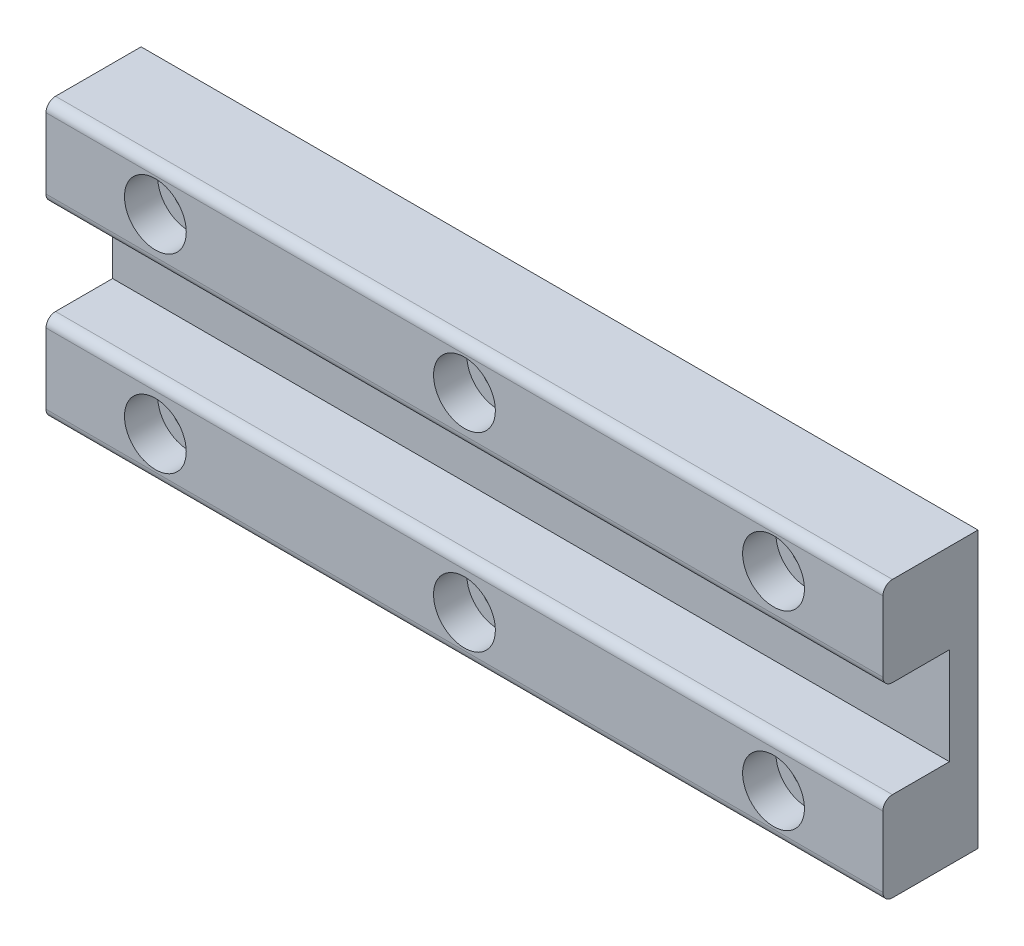
ISO-10303-21;
HEADER;
FILE_DESCRIPTION(('STEP AP214'),'2;1');
FILE_NAME('part.step','',(''),(''),'','','');
FILE_SCHEMA(('AUTOMOTIVE_DESIGN { 1 0 10303 214 1 1 1 1 }'));
ENDSEC;
DATA;
#1=APPLICATION_CONTEXT('core data for automotive mechanical design processes');
#2=APPLICATION_PROTOCOL_DEFINITION('international standard','automotive_design',2000,#1);
#3=PRODUCT_CONTEXT('',#1,'mechanical');
#4=PRODUCT('Part','Part','',(#3));
#5=PRODUCT_RELATED_PRODUCT_CATEGORY('part','',(#4));
#6=PRODUCT_DEFINITION_FORMATION('','',#4);
#7=PRODUCT_DEFINITION_CONTEXT('part definition',#1,'design');
#8=PRODUCT_DEFINITION('design','',#6,#7);
#9=PRODUCT_DEFINITION_SHAPE('','',#8);
#10=(LENGTH_UNIT() NAMED_UNIT(*) SI_UNIT(.MILLI.,.METRE.));
#11=(NAMED_UNIT(*) PLANE_ANGLE_UNIT() SI_UNIT($,.RADIAN.));
#12=(NAMED_UNIT(*) SI_UNIT($,.STERADIAN.) SOLID_ANGLE_UNIT());
#13=UNCERTAINTY_MEASURE_WITH_UNIT(LENGTH_MEASURE(1.E-05),#10,'distance_accuracy_value','');
#14=(GEOMETRIC_REPRESENTATION_CONTEXT(3) GLOBAL_UNCERTAINTY_ASSIGNED_CONTEXT((#13)) GLOBAL_UNIT_ASSIGNED_CONTEXT((#10,
#11,#12)) REPRESENTATION_CONTEXT('',''));
#15=CARTESIAN_POINT('',(0.,0.,0.));
#16=DIRECTION('',(0.,0.,1.));
#17=DIRECTION('',(1.,0.,0.));
#18=AXIS2_PLACEMENT_3D('',#15,#16,#17);
#19=CARTESIAN_POINT('',(-42.,10.,5.));
#20=DIRECTION('',(0.,0.,1.));
#21=DIRECTION('',(1.,0.,0.));
#22=AXIS2_PLACEMENT_3D('',#19,#20,#21);
#23=CYLINDRICAL_SURFACE('',#22,1.75);
#24=CARTESIAN_POINT('',(-42.,10.,5.));
#25=DIRECTION('',(0.,0.,1.));
#26=DIRECTION('',(1.,0.,0.));
#27=AXIS2_PLACEMENT_3D('',#24,#25,#26);
#28=CIRCLE('',#27,1.75);
#29=CARTESIAN_POINT('',(-40.25,10.,5.));
#30=VERTEX_POINT('',#29);
#31=EDGE_CURVE('E157',#30,#30,#28,.T.);
#32=ORIENTED_EDGE('',*,*,#31,.F.);
#33=EDGE_LOOP('',(#32));
#34=FACE_BOUND('',#33,.T.);
#35=CARTESIAN_POINT('',(-42.,10.,11.5));
#36=DIRECTION('',(0.,0.,1.));
#37=DIRECTION('',(1.,0.,0.));
#38=AXIS2_PLACEMENT_3D('',#35,#36,#37);
#39=CIRCLE('',#38,1.75);
#40=CARTESIAN_POINT('',(-40.25,10.,11.5));
#41=VERTEX_POINT('',#40);
#42=EDGE_CURVE('E216',#41,#41,#39,.F.);
#43=ORIENTED_EDGE('',*,*,#42,.F.);
#44=EDGE_LOOP('',(#43));
#45=FACE_BOUND('',#44,.T.);
#46=ADVANCED_FACE('F40',(#34,#45),#23,.F.);
#47=CARTESIAN_POINT('',(-9.49999999999997,10.,5.));
#48=DIRECTION('',(0.,0.,1.));
#49=DIRECTION('',(1.,0.,0.));
#50=AXIS2_PLACEMENT_3D('',#47,#48,#49);
#51=CYLINDRICAL_SURFACE('',#50,1.75);
#52=CARTESIAN_POINT('',(-9.49999999999997,10.,5.));
#53=DIRECTION('',(0.,0.,1.));
#54=DIRECTION('',(1.,0.,0.));
#55=AXIS2_PLACEMENT_3D('',#52,#53,#54);
#56=CIRCLE('',#55,1.75);
#57=CARTESIAN_POINT('',(-7.74999999999997,10.,5.));
#58=VERTEX_POINT('',#57);
#59=EDGE_CURVE('E160',#58,#58,#56,.T.);
#60=ORIENTED_EDGE('',*,*,#59,.F.);
#61=EDGE_LOOP('',(#60));
#62=FACE_BOUND('',#61,.T.);
#63=CARTESIAN_POINT('',(-9.49999999999997,10.,11.5));
#64=DIRECTION('',(0.,0.,1.));
#65=DIRECTION('',(1.,0.,0.));
#66=AXIS2_PLACEMENT_3D('',#63,#64,#65);
#67=CIRCLE('',#66,1.75);
#68=CARTESIAN_POINT('',(-7.74999999999997,10.,11.5));
#69=VERTEX_POINT('',#68);
#70=EDGE_CURVE('E213',#69,#69,#67,.F.);
#71=ORIENTED_EDGE('',*,*,#70,.F.);
#72=EDGE_LOOP('',(#71));
#73=FACE_BOUND('',#72,.T.);
#74=ADVANCED_FACE('F287',(#62,#73),#51,.F.);
#75=CARTESIAN_POINT('',(23.,10.,5.));
#76=DIRECTION('',(0.,0.,1.));
#77=DIRECTION('',(1.,0.,0.));
#78=AXIS2_PLACEMENT_3D('',#75,#76,#77);
#79=CYLINDRICAL_SURFACE('',#78,1.75);
#80=CARTESIAN_POINT('',(23.,10.,5.));
#81=DIRECTION('',(0.,0.,1.));
#82=DIRECTION('',(1.,0.,0.));
#83=AXIS2_PLACEMENT_3D('',#80,#81,#82);
#84=CIRCLE('',#83,1.75);
#85=CARTESIAN_POINT('',(24.75,10.,5.));
#86=VERTEX_POINT('',#85);
#87=EDGE_CURVE('E340',#86,#86,#84,.T.);
#88=ORIENTED_EDGE('',*,*,#87,.F.);
#89=EDGE_LOOP('',(#88));
#90=FACE_BOUND('',#89,.T.);
#91=CARTESIAN_POINT('',(23.,10.,11.5));
#92=DIRECTION('',(0.,0.,1.));
#93=DIRECTION('',(1.,0.,0.));
#94=AXIS2_PLACEMENT_3D('',#91,#92,#93);
#95=CIRCLE('',#94,1.75);
#96=CARTESIAN_POINT('',(24.75,10.,11.5));
#97=VERTEX_POINT('',#96);
#98=EDGE_CURVE('E210',#97,#97,#95,.F.);
#99=ORIENTED_EDGE('',*,*,#98,.F.);
#100=EDGE_LOOP('',(#99));
#101=FACE_BOUND('',#100,.T.);
#102=ADVANCED_FACE('F293',(#90,#101),#79,.F.);
#103=CARTESIAN_POINT('',(23.,-9.99999999999998,5.));
#104=DIRECTION('',(0.,0.,1.));
#105=DIRECTION('',(1.,0.,0.));
#106=AXIS2_PLACEMENT_3D('',#103,#104,#105);
#107=CYLINDRICAL_SURFACE('',#106,1.75);
#108=CARTESIAN_POINT('',(23.,-9.99999999999998,5.));
#109=DIRECTION('',(0.,0.,1.));
#110=DIRECTION('',(1.,0.,0.));
#111=AXIS2_PLACEMENT_3D('',#108,#109,#110);
#112=CIRCLE('',#111,1.75);
#113=CARTESIAN_POINT('',(24.75,-9.99999999999998,5.));
#114=VERTEX_POINT('',#113);
#115=EDGE_CURVE('E336',#114,#114,#112,.T.);
#116=ORIENTED_EDGE('',*,*,#115,.F.);
#117=EDGE_LOOP('',(#116));
#118=FACE_BOUND('',#117,.T.);
#119=CARTESIAN_POINT('',(23.,-9.99999999999998,11.5));
#120=DIRECTION('',(0.,0.,1.));
#121=DIRECTION('',(1.,0.,0.));
#122=AXIS2_PLACEMENT_3D('',#119,#120,#121);
#123=CIRCLE('',#122,1.75);
#124=CARTESIAN_POINT('',(24.75,-9.99999999999998,11.5));
#125=VERTEX_POINT('',#124);
#126=EDGE_CURVE('E207',#125,#125,#123,.F.);
#127=ORIENTED_EDGE('',*,*,#126,.F.);
#128=EDGE_LOOP('',(#127));
#129=FACE_BOUND('',#128,.T.);
#130=ADVANCED_FACE('F413',(#118,#129),#107,.F.);
#131=CARTESIAN_POINT('',(-9.49999999999997,-9.99999999999999,5.));
#132=DIRECTION('',(0.,0.,1.));
#133=DIRECTION('',(1.,0.,0.));
#134=AXIS2_PLACEMENT_3D('',#131,#132,#133);
#135=CYLINDRICAL_SURFACE('',#134,1.75);
#136=CARTESIAN_POINT('',(-9.49999999999997,-9.99999999999999,5.));
#137=DIRECTION('',(0.,0.,1.));
#138=DIRECTION('',(1.,0.,0.));
#139=AXIS2_PLACEMENT_3D('',#136,#137,#138);
#140=CIRCLE('',#139,1.75);
#141=CARTESIAN_POINT('',(-7.74999999999997,-9.99999999999999,5.));
#142=VERTEX_POINT('',#141);
#143=EDGE_CURVE('E332',#142,#142,#140,.T.);
#144=ORIENTED_EDGE('',*,*,#143,.F.);
#145=EDGE_LOOP('',(#144));
#146=FACE_BOUND('',#145,.T.);
#147=CARTESIAN_POINT('',(-9.49999999999997,-9.99999999999999,11.5));
#148=DIRECTION('',(0.,0.,1.));
#149=DIRECTION('',(1.,0.,0.));
#150=AXIS2_PLACEMENT_3D('',#147,#148,#149);
#151=CIRCLE('',#150,1.75);
#152=CARTESIAN_POINT('',(-7.74999999999997,-9.99999999999999,11.5));
#153=VERTEX_POINT('',#152);
#154=EDGE_CURVE('E203',#153,#153,#151,.F.);
#155=ORIENTED_EDGE('',*,*,#154,.F.);
#156=EDGE_LOOP('',(#155));
#157=FACE_BOUND('',#156,.T.);
#158=ADVANCED_FACE('F416',(#146,#157),#135,.F.);
#159=CARTESIAN_POINT('',(-42.,-9.99999999999999,5.));
#160=DIRECTION('',(0.,0.,1.));
#161=DIRECTION('',(1.,0.,0.));
#162=AXIS2_PLACEMENT_3D('',#159,#160,#161);
#163=CYLINDRICAL_SURFACE('',#162,1.75);
#164=CARTESIAN_POINT('',(-42.,-9.99999999999999,5.));
#165=DIRECTION('',(0.,0.,1.));
#166=DIRECTION('',(1.,0.,0.));
#167=AXIS2_PLACEMENT_3D('',#164,#165,#166);
#168=CIRCLE('',#167,1.75);
#169=CARTESIAN_POINT('',(-40.25,-9.99999999999999,5.));
#170=VERTEX_POINT('',#169);
#171=EDGE_CURVE('E219',#170,#170,#168,.T.);
#172=ORIENTED_EDGE('',*,*,#171,.F.);
#173=EDGE_LOOP('',(#172));
#174=FACE_BOUND('',#173,.T.);
#175=CARTESIAN_POINT('',(-42.,-9.99999999999999,11.5));
#176=DIRECTION('',(0.,0.,1.));
#177=DIRECTION('',(1.,0.,0.));
#178=AXIS2_PLACEMENT_3D('',#175,#176,#177);
#179=CIRCLE('',#178,1.75);
#180=CARTESIAN_POINT('',(-40.25,-9.99999999999999,11.5));
#181=VERTEX_POINT('',#180);
#182=EDGE_CURVE('E200',#181,#181,#179,.F.);
#183=ORIENTED_EDGE('',*,*,#182,.F.);
#184=EDGE_LOOP('',(#183));
#185=FACE_BOUND('',#184,.T.);
#186=ADVANCED_FACE('F300',(#174,#185),#163,.F.);
#187=CARTESIAN_POINT('',(0.,0.,15.));
#188=DIRECTION('',(0.,0.,1.));
#189=DIRECTION('',(1.,0.,0.));
#190=AXIS2_PLACEMENT_3D('',#187,#188,#189);
#191=PLANE('',#190);
#192=CARTESIAN_POINT('',(23.,10.,15.));
#193=DIRECTION('',(0.,0.,1.));
#194=DIRECTION('',(1.,0.,0.));
#195=AXIS2_PLACEMENT_3D('',#192,#193,#194);
#196=CIRCLE('',#195,3.25);
#197=CARTESIAN_POINT('',(26.25,10.,15.));
#198=VERTEX_POINT('',#197);
#199=EDGE_CURVE('E373',#198,#198,#196,.T.);
#200=ORIENTED_EDGE('',*,*,#199,.F.);
#201=EDGE_LOOP('',(#200));
#202=FACE_BOUND('',#201,.T.);
#203=CARTESIAN_POINT('',(-9.49999999999997,10.,15.));
#204=DIRECTION('',(0.,0.,1.));
#205=DIRECTION('',(1.,0.,0.));
#206=AXIS2_PLACEMENT_3D('',#203,#204,#205);
#207=CIRCLE('',#206,3.25);
#208=CARTESIAN_POINT('',(-6.24999999999997,10.,15.));
#209=VERTEX_POINT('',#208);
#210=EDGE_CURVE('E379',#209,#209,#207,.T.);
#211=ORIENTED_EDGE('',*,*,#210,.F.);
#212=EDGE_LOOP('',(#211));
#213=FACE_BOUND('',#212,.T.);
#214=CARTESIAN_POINT('',(-42.,10.,15.));
#215=DIRECTION('',(0.,0.,1.));
#216=DIRECTION('',(1.,0.,0.));
#217=AXIS2_PLACEMENT_3D('',#214,#215,#216);
#218=CIRCLE('',#217,3.25);
#219=CARTESIAN_POINT('',(-38.75,10.,15.));
#220=VERTEX_POINT('',#219);
#221=EDGE_CURVE('E347',#220,#220,#218,.T.);
#222=ORIENTED_EDGE('',*,*,#221,.F.);
#223=EDGE_LOOP('',(#222));
#224=FACE_BOUND('',#223,.T.);
#225=DIRECTION('',(0.,-1.,0.));
#226=VECTOR('',#225,1.);
#227=CARTESIAN_POINT('',(-53.5,-10.,15.));
#228=LINE('',#227,#226);
#229=CARTESIAN_POINT('',(-53.5,13.5,15.));
#230=VERTEX_POINT('',#229);
#231=CARTESIAN_POINT('',(-53.5,6.1,15.));
#232=VERTEX_POINT('',#231);
#233=EDGE_CURVE('E180',#230,#232,#228,.T.);
#234=ORIENTED_EDGE('',*,*,#233,.T.);
#235=DIRECTION('',(-1.,0.,0.));
#236=VECTOR('',#235,1.);
#237=CARTESIAN_POINT('',(34.5,6.1,15.));
#238=LINE('',#237,#236);
#239=CARTESIAN_POINT('',(34.5,6.1,15.));
#240=VERTEX_POINT('',#239);
#241=EDGE_CURVE('E48',#232,#240,#238,.F.);
#242=ORIENTED_EDGE('',*,*,#241,.T.);
#243=DIRECTION('',(0.,1.,0.));
#244=VECTOR('',#243,1.);
#245=CARTESIAN_POINT('',(34.5,-9.99999999999999,15.));
#246=LINE('',#245,#244);
#247=CARTESIAN_POINT('',(34.5,13.5,15.));
#248=VERTEX_POINT('',#247);
#249=EDGE_CURVE('E168',#240,#248,#246,.T.);
#250=ORIENTED_EDGE('',*,*,#249,.T.);
#251=DIRECTION('',(1.,0.,0.));
#252=VECTOR('',#251,1.);
#253=CARTESIAN_POINT('',(0.,13.5,15.));
#254=LINE('',#253,#252);
#255=EDGE_CURVE('E245',#248,#230,#254,.F.);
#256=ORIENTED_EDGE('',*,*,#255,.T.);
#257=EDGE_LOOP('',(#234,#242,#250,#256));
#258=FACE_BOUND('',#257,.T.);
#259=ADVANCED_FACE('F249',(#202,#213,#224,#258),#191,.T.);
#260=CARTESIAN_POINT('',(-53.5,-10.,15.));
#261=DIRECTION('',(1.,0.,0.));
#262=DIRECTION('',(0.,0.,-1.));
#263=AXIS2_PLACEMENT_3D('',#260,#261,#262);
#264=PLANE('',#263);
#265=DIRECTION('',(0.,0.,-1.));
#266=VECTOR('',#265,1.);
#267=CARTESIAN_POINT('',(-53.5,-14.5,15.));
#268=LINE('',#267,#266);
#269=CARTESIAN_POINT('',(-53.5,-14.5,14.));
#270=VERTEX_POINT('',#269);
#271=CARTESIAN_POINT('',(-53.5,-14.5,5.));
#272=VERTEX_POINT('',#271);
#273=EDGE_CURVE('E151',#270,#272,#268,.T.);
#274=ORIENTED_EDGE('',*,*,#273,.F.);
#275=CARTESIAN_POINT('',(-53.5,-13.5,14.));
#276=DIRECTION('',(1.,0.,0.));
#277=DIRECTION('',(0.,0.,-1.));
#278=AXIS2_PLACEMENT_3D('',#275,#276,#277);
#279=CIRCLE('',#278,1.);
#280=CARTESIAN_POINT('',(-53.5,-13.5,15.));
#281=VERTEX_POINT('',#280);
#282=EDGE_CURVE('E237',#270,#281,#279,.F.);
#283=ORIENTED_EDGE('',*,*,#282,.T.);
#284=CARTESIAN_POINT('',(-53.5,-6.1,15.));
#285=VERTEX_POINT('',#284);
#286=EDGE_CURVE('E142',#285,#281,#228,.T.);
#287=ORIENTED_EDGE('',*,*,#286,.F.);
#288=CARTESIAN_POINT('',(-53.5,-6.1,14.));
#289=DIRECTION('',(1.,0.,0.));
#290=DIRECTION('',(0.,0.,-1.));
#291=AXIS2_PLACEMENT_3D('',#288,#289,#290);
#292=CIRCLE('',#291,1.);
#293=CARTESIAN_POINT('',(-53.5,-5.1,14.));
#294=VERTEX_POINT('',#293);
#295=EDGE_CURVE('E55',#285,#294,#292,.F.);
#296=ORIENTED_EDGE('',*,*,#295,.T.);
#297=DIRECTION('',(0.,0.,1.));
#298=VECTOR('',#297,1.);
#299=CARTESIAN_POINT('',(-53.5,-5.1,8.));
#300=LINE('',#299,#298);
#301=CARTESIAN_POINT('',(-53.5,-5.1,8.));
#302=VERTEX_POINT('',#301);
#303=EDGE_CURVE('E186',#302,#294,#300,.T.);
#304=ORIENTED_EDGE('',*,*,#303,.F.);
#305=DIRECTION('',(0.,-1.,0.));
#306=VECTOR('',#305,1.);
#307=CARTESIAN_POINT('',(-53.5,-10.,8.));
#308=LINE('',#307,#306);
#309=CARTESIAN_POINT('',(-53.5,5.1,8.));
#310=VERTEX_POINT('',#309);
#311=EDGE_CURVE('E184',#310,#302,#308,.T.);
#312=ORIENTED_EDGE('',*,*,#311,.F.);
#313=DIRECTION('',(0.,0.,1.));
#314=VECTOR('',#313,1.);
#315=CARTESIAN_POINT('',(-53.5,5.1,8.));
#316=LINE('',#315,#314);
#317=CARTESIAN_POINT('',(-53.5,5.1,14.));
#318=VERTEX_POINT('',#317);
#319=EDGE_CURVE('E177',#310,#318,#316,.T.);
#320=ORIENTED_EDGE('',*,*,#319,.T.);
#321=CARTESIAN_POINT('',(-53.5,6.1,14.));
#322=DIRECTION('',(1.,0.,0.));
#323=DIRECTION('',(0.,0.,-1.));
#324=AXIS2_PLACEMENT_3D('',#321,#322,#323);
#325=CIRCLE('',#324,1.);
#326=EDGE_CURVE('E234',#318,#232,#325,.F.);
#327=ORIENTED_EDGE('',*,*,#326,.T.);
#328=ORIENTED_EDGE('',*,*,#233,.F.);
#329=CARTESIAN_POINT('',(-53.5,13.5,14.));
#330=DIRECTION('',(1.,0.,0.));
#331=DIRECTION('',(0.,0.,-1.));
#332=AXIS2_PLACEMENT_3D('',#329,#330,#331);
#333=CIRCLE('',#332,1.);
#334=CARTESIAN_POINT('',(-53.5,14.5,14.));
#335=VERTEX_POINT('',#334);
#336=EDGE_CURVE('E62',#230,#335,#333,.F.);
#337=ORIENTED_EDGE('',*,*,#336,.T.);
#338=DIRECTION('',(0.,0.,-1.));
#339=VECTOR('',#338,1.);
#340=CARTESIAN_POINT('',(-53.5,14.5,15.));
#341=LINE('',#340,#339);
#342=CARTESIAN_POINT('',(-53.5,14.5,5.));
#343=VERTEX_POINT('',#342);
#344=EDGE_CURVE('E166',#335,#343,#341,.T.);
#345=ORIENTED_EDGE('',*,*,#344,.T.);
#346=DIRECTION('',(0.,-1.,0.));
#347=VECTOR('',#346,1.);
#348=CARTESIAN_POINT('',(-53.5,-10.,5.));
#349=LINE('',#348,#347);
#350=EDGE_CURVE('E175',#343,#272,#349,.T.);
#351=ORIENTED_EDGE('',*,*,#350,.T.);
#352=EDGE_LOOP('',(#274,#283,#287,#296,#304,#312,#320,#327,#328,#337,#345,#351));
#353=FACE_BOUND('',#352,.T.);
#354=ADVANCED_FACE('F260',(#353),#264,.F.);
#355=CARTESIAN_POINT('',(34.5,-9.99999999999999,15.));
#356=DIRECTION('',(-1.,0.,0.));
#357=DIRECTION('',(0.,0.,1.));
#358=AXIS2_PLACEMENT_3D('',#355,#356,#357);
#359=PLANE('',#358);
#360=CARTESIAN_POINT('',(34.5,-13.5,15.));
#361=VERTEX_POINT('',#360);
#362=CARTESIAN_POINT('',(34.5,-6.1,15.));
#363=VERTEX_POINT('',#362);
#364=EDGE_CURVE('E181',#361,#363,#246,.T.);
#365=ORIENTED_EDGE('',*,*,#364,.F.);
#366=CARTESIAN_POINT('',(34.5,-13.5,14.));
#367=DIRECTION('',(-1.,0.,0.));
#368=DIRECTION('',(0.,0.,1.));
#369=AXIS2_PLACEMENT_3D('',#366,#367,#368);
#370=CIRCLE('',#369,1.);
#371=CARTESIAN_POINT('',(34.5,-14.5,14.));
#372=VERTEX_POINT('',#371);
#373=EDGE_CURVE('E156',#361,#372,#370,.F.);
#374=ORIENTED_EDGE('',*,*,#373,.T.);
#375=DIRECTION('',(0.,0.,1.));
#376=VECTOR('',#375,1.);
#377=CARTESIAN_POINT('',(34.5,-14.5,15.));
#378=LINE('',#377,#376);
#379=CARTESIAN_POINT('',(34.5,-14.5,5.));
#380=VERTEX_POINT('',#379);
#381=EDGE_CURVE('E148',#380,#372,#378,.T.);
#382=ORIENTED_EDGE('',*,*,#381,.F.);
#383=DIRECTION('',(0.,1.,0.));
#384=VECTOR('',#383,1.);
#385=CARTESIAN_POINT('',(34.5,-9.99999999999999,5.));
#386=LINE('',#385,#384);
#387=CARTESIAN_POINT('',(34.5,14.5,5.));
#388=VERTEX_POINT('',#387);
#389=EDGE_CURVE('E131',#380,#388,#386,.T.);
#390=ORIENTED_EDGE('',*,*,#389,.T.);
#391=DIRECTION('',(0.,0.,1.));
#392=VECTOR('',#391,1.);
#393=CARTESIAN_POINT('',(34.5,14.5,15.));
#394=LINE('',#393,#392);
#395=CARTESIAN_POINT('',(34.5,14.5,14.));
#396=VERTEX_POINT('',#395);
#397=EDGE_CURVE('E165',#388,#396,#394,.T.);
#398=ORIENTED_EDGE('',*,*,#397,.T.);
#399=CARTESIAN_POINT('',(34.5,13.5,14.));
#400=DIRECTION('',(-1.,0.,0.));
#401=DIRECTION('',(0.,0.,1.));
#402=AXIS2_PLACEMENT_3D('',#399,#400,#401);
#403=CIRCLE('',#402,1.);
#404=EDGE_CURVE('E224',#396,#248,#403,.F.);
#405=ORIENTED_EDGE('',*,*,#404,.T.);
#406=ORIENTED_EDGE('',*,*,#249,.F.);
#407=CARTESIAN_POINT('',(34.5,6.1,14.));
#408=DIRECTION('',(-1.,0.,0.));
#409=DIRECTION('',(0.,0.,1.));
#410=AXIS2_PLACEMENT_3D('',#407,#408,#409);
#411=CIRCLE('',#410,1.);
#412=CARTESIAN_POINT('',(34.5,5.1,14.));
#413=VERTEX_POINT('',#412);
#414=EDGE_CURVE('E226',#240,#413,#411,.F.);
#415=ORIENTED_EDGE('',*,*,#414,.T.);
#416=DIRECTION('',(0.,0.,1.));
#417=VECTOR('',#416,1.);
#418=CARTESIAN_POINT('',(34.5,5.1,8.));
#419=LINE('',#418,#417);
#420=CARTESIAN_POINT('',(34.5,5.1,8.));
#421=VERTEX_POINT('',#420);
#422=EDGE_CURVE('E189',#421,#413,#419,.T.);
#423=ORIENTED_EDGE('',*,*,#422,.F.);
#424=DIRECTION('',(0.,1.,0.));
#425=VECTOR('',#424,1.);
#426=CARTESIAN_POINT('',(34.5,-9.99999999999999,8.));
#427=LINE('',#426,#425);
#428=CARTESIAN_POINT('',(34.5,-5.1,8.));
#429=VERTEX_POINT('',#428);
#430=EDGE_CURVE('E171',#429,#421,#427,.T.);
#431=ORIENTED_EDGE('',*,*,#430,.F.);
#432=DIRECTION('',(0.,0.,1.));
#433=VECTOR('',#432,1.);
#434=CARTESIAN_POINT('',(34.5,-5.1,8.));
#435=LINE('',#434,#433);
#436=CARTESIAN_POINT('',(34.5,-5.1,14.));
#437=VERTEX_POINT('',#436);
#438=EDGE_CURVE('E143',#429,#437,#435,.T.);
#439=ORIENTED_EDGE('',*,*,#438,.T.);
#440=CARTESIAN_POINT('',(34.5,-6.1,14.));
#441=DIRECTION('',(-1.,0.,0.));
#442=DIRECTION('',(0.,0.,1.));
#443=AXIS2_PLACEMENT_3D('',#440,#441,#442);
#444=CIRCLE('',#443,1.);
#445=EDGE_CURVE('E228',#437,#363,#444,.F.);
#446=ORIENTED_EDGE('',*,*,#445,.T.);
#447=EDGE_LOOP('',(#365,#374,#382,#390,#398,#405,#406,#415,#423,#431,#439,#446));
#448=FACE_BOUND('',#447,.T.);
#449=ADVANCED_FACE('F155',(#448),#359,.F.);
#450=CARTESIAN_POINT('',(-42.,-9.99999999999999,15.));
#451=DIRECTION('',(0.,0.,1.));
#452=DIRECTION('',(1.,0.,0.));
#453=AXIS2_PLACEMENT_3D('',#450,#451,#452);
#454=CIRCLE('',#453,3.25);
#455=CARTESIAN_POINT('',(-38.75,-9.99999999999999,15.));
#456=VERTEX_POINT('',#455);
#457=EDGE_CURVE('E355',#456,#456,#454,.T.);
#458=ORIENTED_EDGE('',*,*,#457,.F.);
#459=EDGE_LOOP('',(#458));
#460=FACE_BOUND('',#459,.T.);
#461=CARTESIAN_POINT('',(-9.49999999999997,-9.99999999999999,15.));
#462=DIRECTION('',(0.,0.,1.));
#463=DIRECTION('',(1.,0.,0.));
#464=AXIS2_PLACEMENT_3D('',#461,#462,#463);
#465=CIRCLE('',#464,3.25);
#466=CARTESIAN_POINT('',(-6.24999999999997,-9.99999999999999,15.));
#467=VERTEX_POINT('',#466);
#468=EDGE_CURVE('E361',#467,#467,#465,.T.);
#469=ORIENTED_EDGE('',*,*,#468,.F.);
#470=EDGE_LOOP('',(#469));
#471=FACE_BOUND('',#470,.T.);
#472=CARTESIAN_POINT('',(23.,-9.99999999999998,15.));
#473=DIRECTION('',(0.,0.,1.));
#474=DIRECTION('',(1.,0.,0.));
#475=AXIS2_PLACEMENT_3D('',#472,#473,#474);
#476=CIRCLE('',#475,3.25);
#477=CARTESIAN_POINT('',(26.25,-9.99999999999998,15.));
#478=VERTEX_POINT('',#477);
#479=EDGE_CURVE('E367',#478,#478,#476,.T.);
#480=ORIENTED_EDGE('',*,*,#479,.F.);
#481=EDGE_LOOP('',(#480));
#482=FACE_BOUND('',#481,.T.);
#483=ORIENTED_EDGE('',*,*,#286,.T.);
#484=DIRECTION('',(1.,0.,0.));
#485=VECTOR('',#484,1.);
#486=CARTESIAN_POINT('',(34.5,-13.5,15.));
#487=LINE('',#486,#485);
#488=EDGE_CURVE('E221',#281,#361,#487,.T.);
#489=ORIENTED_EDGE('',*,*,#488,.T.);
#490=ORIENTED_EDGE('',*,*,#364,.T.);
#491=DIRECTION('',(1.,0.,0.));
#492=VECTOR('',#491,1.);
#493=CARTESIAN_POINT('',(-53.5,-6.1,15.));
#494=LINE('',#493,#492);
#495=EDGE_CURVE('E188',#363,#285,#494,.F.);
#496=ORIENTED_EDGE('',*,*,#495,.T.);
#497=EDGE_LOOP('',(#483,#489,#490,#496));
#498=FACE_BOUND('',#497,.T.);
#499=ADVANCED_FACE('F273',(#460,#471,#482,#498),#191,.T.);
#500=CARTESIAN_POINT('',(-53.5,0.,8.));
#501=DIRECTION('',(0.,0.,1.));
#502=DIRECTION('',(1.,0.,0.));
#503=AXIS2_PLACEMENT_3D('',#500,#501,#502);
#504=PLANE('',#503);
#505=ORIENTED_EDGE('',*,*,#311,.T.);
#506=DIRECTION('',(1.,0.,0.));
#507=VECTOR('',#506,1.);
#508=CARTESIAN_POINT('',(-53.5,-5.1,8.));
#509=LINE('',#508,#507);
#510=EDGE_CURVE('E173',#302,#429,#509,.T.);
#511=ORIENTED_EDGE('',*,*,#510,.T.);
#512=ORIENTED_EDGE('',*,*,#430,.T.);
#513=DIRECTION('',(-1.,0.,0.));
#514=VECTOR('',#513,1.);
#515=CARTESIAN_POINT('',(-53.5,5.1,8.));
#516=LINE('',#515,#514);
#517=EDGE_CURVE('E172',#421,#310,#516,.T.);
#518=ORIENTED_EDGE('',*,*,#517,.T.);
#519=EDGE_LOOP('',(#505,#511,#512,#518));
#520=FACE_BOUND('',#519,.T.);
#521=ADVANCED_FACE('F263',(#520),#504,.T.);
#522=CARTESIAN_POINT('',(-53.5,5.1,8.));
#523=DIRECTION('',(0.,1.,0.));
#524=DIRECTION('',(0.,0.,1.));
#525=AXIS2_PLACEMENT_3D('',#522,#523,#524);
#526=PLANE('',#525);
#527=ORIENTED_EDGE('',*,*,#422,.T.);
#528=DIRECTION('',(-1.,0.,0.));
#529=VECTOR('',#528,1.);
#530=CARTESIAN_POINT('',(-53.5,5.1,14.));
#531=LINE('',#530,#529);
#532=EDGE_CURVE('E242',#413,#318,#531,.T.);
#533=ORIENTED_EDGE('',*,*,#532,.T.);
#534=ORIENTED_EDGE('',*,*,#319,.F.);
#535=ORIENTED_EDGE('',*,*,#517,.F.);
#536=EDGE_LOOP('',(#527,#533,#534,#535));
#537=FACE_BOUND('',#536,.T.);
#538=ADVANCED_FACE('F257',(#537),#526,.F.);
#539=CARTESIAN_POINT('',(-53.5,-5.1,8.));
#540=DIRECTION('',(0.,-1.,0.));
#541=DIRECTION('',(0.,0.,-1.));
#542=AXIS2_PLACEMENT_3D('',#539,#540,#541);
#543=PLANE('',#542);
#544=ORIENTED_EDGE('',*,*,#303,.T.);
#545=DIRECTION('',(1.,0.,0.));
#546=VECTOR('',#545,1.);
#547=CARTESIAN_POINT('',(34.5,-5.1,14.));
#548=LINE('',#547,#546);
#549=EDGE_CURVE('E239',#294,#437,#548,.T.);
#550=ORIENTED_EDGE('',*,*,#549,.T.);
#551=ORIENTED_EDGE('',*,*,#438,.F.);
#552=ORIENTED_EDGE('',*,*,#510,.F.);
#553=EDGE_LOOP('',(#544,#550,#551,#552));
#554=FACE_BOUND('',#553,.T.);
#555=ADVANCED_FACE('F266',(#554),#543,.F.);
#556=CARTESIAN_POINT('',(0.,0.,5.));
#557=DIRECTION('',(0.,0.,1.));
#558=DIRECTION('',(1.,0.,0.));
#559=AXIS2_PLACEMENT_3D('',#556,#557,#558);
#560=PLANE('',#559);
#561=ORIENTED_EDGE('',*,*,#171,.T.);
#562=EDGE_LOOP('',(#561));
#563=FACE_BOUND('',#562,.T.);
#564=ORIENTED_EDGE('',*,*,#143,.T.);
#565=EDGE_LOOP('',(#564));
#566=FACE_BOUND('',#565,.T.);
#567=ORIENTED_EDGE('',*,*,#115,.T.);
#568=EDGE_LOOP('',(#567));
#569=FACE_BOUND('',#568,.T.);
#570=ORIENTED_EDGE('',*,*,#87,.T.);
#571=EDGE_LOOP('',(#570));
#572=FACE_BOUND('',#571,.T.);
#573=ORIENTED_EDGE('',*,*,#59,.T.);
#574=EDGE_LOOP('',(#573));
#575=FACE_BOUND('',#574,.T.);
#576=ORIENTED_EDGE('',*,*,#31,.T.);
#577=EDGE_LOOP('',(#576));
#578=FACE_BOUND('',#577,.T.);
#579=ORIENTED_EDGE('',*,*,#350,.F.);
#580=DIRECTION('',(1.,0.,0.));
#581=VECTOR('',#580,1.);
#582=CARTESIAN_POINT('',(-64.4658560997306,14.5,5.));
#583=LINE('',#582,#581);
#584=EDGE_CURVE('E137',#343,#388,#583,.T.);
#585=ORIENTED_EDGE('',*,*,#584,.T.);
#586=ORIENTED_EDGE('',*,*,#389,.F.);
#587=DIRECTION('',(1.,0.,0.));
#588=VECTOR('',#587,1.);
#589=CARTESIAN_POINT('',(-64.4658560997306,-14.5,5.));
#590=LINE('',#589,#588);
#591=EDGE_CURVE('E135',#272,#380,#590,.T.);
#592=ORIENTED_EDGE('',*,*,#591,.F.);
#593=EDGE_LOOP('',(#579,#585,#586,#592));
#594=FACE_BOUND('',#593,.T.);
#595=ADVANCED_FACE('F134',(#563,#566,#569,#572,#575,#578,#594),#560,.F.);
#596=CARTESIAN_POINT('',(-64.4658560997306,14.5,15.));
#597=DIRECTION('',(0.,1.,0.));
#598=DIRECTION('',(0.,0.,1.));
#599=AXIS2_PLACEMENT_3D('',#596,#597,#598);
#600=PLANE('',#599);
#601=ORIENTED_EDGE('',*,*,#344,.F.);
#602=DIRECTION('',(1.,0.,0.));
#603=VECTOR('',#602,1.);
#604=CARTESIAN_POINT('',(-64.4658560997306,14.5,14.));
#605=LINE('',#604,#603);
#606=EDGE_CURVE('E11',#335,#396,#605,.T.);
#607=ORIENTED_EDGE('',*,*,#606,.T.);
#608=ORIENTED_EDGE('',*,*,#397,.F.);
#609=ORIENTED_EDGE('',*,*,#584,.F.);
#610=EDGE_LOOP('',(#601,#607,#608,#609));
#611=FACE_BOUND('',#610,.T.);
#612=ADVANCED_FACE('F305',(#611),#600,.T.);
#613=CARTESIAN_POINT('',(-64.4658560997306,-14.5,15.));
#614=DIRECTION('',(0.,1.,0.));
#615=DIRECTION('',(0.,0.,1.));
#616=AXIS2_PLACEMENT_3D('',#613,#614,#615);
#617=PLANE('',#616);
#618=ORIENTED_EDGE('',*,*,#381,.T.);
#619=DIRECTION('',(1.,0.,0.));
#620=VECTOR('',#619,1.);
#621=CARTESIAN_POINT('',(-53.5,-14.5,14.));
#622=LINE('',#621,#620);
#623=EDGE_CURVE('E231',#372,#270,#622,.F.);
#624=ORIENTED_EDGE('',*,*,#623,.T.);
#625=ORIENTED_EDGE('',*,*,#273,.T.);
#626=ORIENTED_EDGE('',*,*,#591,.T.);
#627=EDGE_LOOP('',(#618,#624,#625,#626));
#628=FACE_BOUND('',#627,.T.);
#629=ADVANCED_FACE('F147',(#628),#617,.F.);
#630=CARTESIAN_POINT('',(-42.,-9.99999999999999,11.5));
#631=DIRECTION('',(0.,0.,1.));
#632=DIRECTION('',(1.,0.,0.));
#633=AXIS2_PLACEMENT_3D('',#630,#631,#632);
#634=PLANE('',#633);
#635=CARTESIAN_POINT('',(-42.,-9.99999999999999,11.5));
#636=DIRECTION('',(0.,0.,1.));
#637=DIRECTION('',(1.,0.,0.));
#638=AXIS2_PLACEMENT_3D('',#635,#636,#637);
#639=CIRCLE('',#638,3.25);
#640=CARTESIAN_POINT('',(-38.75,-9.99999999999999,11.5));
#641=VERTEX_POINT('',#640);
#642=EDGE_CURVE('E358',#641,#641,#639,.T.);
#643=ORIENTED_EDGE('',*,*,#642,.T.);
#644=EDGE_LOOP('',(#643));
#645=FACE_BOUND('',#644,.T.);
#646=ORIENTED_EDGE('',*,*,#182,.T.);
#647=EDGE_LOOP('',(#646));
#648=FACE_BOUND('',#647,.T.);
#649=ADVANCED_FACE('F304',(#645,#648),#634,.T.);
#650=CARTESIAN_POINT('',(-42.,-9.99999999999999,11.5));
#651=DIRECTION('',(0.,0.,1.));
#652=DIRECTION('',(1.,0.,0.));
#653=AXIS2_PLACEMENT_3D('',#650,#651,#652);
#654=CYLINDRICAL_SURFACE('',#653,3.25);
#655=ORIENTED_EDGE('',*,*,#642,.F.);
#656=EDGE_LOOP('',(#655));
#657=FACE_BOUND('',#656,.T.);
#658=ORIENTED_EDGE('',*,*,#457,.T.);
#659=EDGE_LOOP('',(#658));
#660=FACE_BOUND('',#659,.T.);
#661=ADVANCED_FACE('F430',(#657,#660),#654,.F.);
#662=CARTESIAN_POINT('',(-9.49999999999997,-9.99999999999999,11.5));
#663=DIRECTION('',(0.,0.,1.));
#664=DIRECTION('',(1.,0.,0.));
#665=AXIS2_PLACEMENT_3D('',#662,#663,#664);
#666=PLANE('',#665);
#667=CARTESIAN_POINT('',(-9.49999999999997,-9.99999999999999,11.5));
#668=DIRECTION('',(0.,0.,1.));
#669=DIRECTION('',(1.,0.,0.));
#670=AXIS2_PLACEMENT_3D('',#667,#668,#669);
#671=CIRCLE('',#670,3.25);
#672=CARTESIAN_POINT('',(-6.24999999999997,-9.99999999999999,11.5));
#673=VERTEX_POINT('',#672);
#674=EDGE_CURVE('E364',#673,#673,#671,.T.);
#675=ORIENTED_EDGE('',*,*,#674,.T.);
#676=EDGE_LOOP('',(#675));
#677=FACE_BOUND('',#676,.T.);
#678=ORIENTED_EDGE('',*,*,#154,.T.);
#679=EDGE_LOOP('',(#678));
#680=FACE_BOUND('',#679,.T.);
#681=ADVANCED_FACE('F427',(#677,#680),#666,.T.);
#682=CARTESIAN_POINT('',(-9.49999999999997,-9.99999999999999,11.5));
#683=DIRECTION('',(0.,0.,1.));
#684=DIRECTION('',(1.,0.,0.));
#685=AXIS2_PLACEMENT_3D('',#682,#683,#684);
#686=CYLINDRICAL_SURFACE('',#685,3.25);
#687=ORIENTED_EDGE('',*,*,#674,.F.);
#688=EDGE_LOOP('',(#687));
#689=FACE_BOUND('',#688,.T.);
#690=ORIENTED_EDGE('',*,*,#468,.T.);
#691=EDGE_LOOP('',(#690));
#692=FACE_BOUND('',#691,.T.);
#693=ADVANCED_FACE('F429',(#689,#692),#686,.F.);
#694=CARTESIAN_POINT('',(23.,-9.99999999999998,11.5));
#695=DIRECTION('',(0.,0.,1.));
#696=DIRECTION('',(1.,0.,0.));
#697=AXIS2_PLACEMENT_3D('',#694,#695,#696);
#698=PLANE('',#697);
#699=CARTESIAN_POINT('',(23.,-9.99999999999998,11.5));
#700=DIRECTION('',(0.,0.,1.));
#701=DIRECTION('',(1.,0.,0.));
#702=AXIS2_PLACEMENT_3D('',#699,#700,#701);
#703=CIRCLE('',#702,3.25);
#704=CARTESIAN_POINT('',(26.25,-9.99999999999998,11.5));
#705=VERTEX_POINT('',#704);
#706=EDGE_CURVE('E370',#705,#705,#703,.T.);
#707=ORIENTED_EDGE('',*,*,#706,.T.);
#708=EDGE_LOOP('',(#707));
#709=FACE_BOUND('',#708,.T.);
#710=ORIENTED_EDGE('',*,*,#126,.T.);
#711=EDGE_LOOP('',(#710));
#712=FACE_BOUND('',#711,.T.);
#713=ADVANCED_FACE('F437',(#709,#712),#698,.T.);
#714=CARTESIAN_POINT('',(23.,-9.99999999999998,11.5));
#715=DIRECTION('',(0.,0.,1.));
#716=DIRECTION('',(1.,0.,0.));
#717=AXIS2_PLACEMENT_3D('',#714,#715,#716);
#718=CYLINDRICAL_SURFACE('',#717,3.25);
#719=ORIENTED_EDGE('',*,*,#706,.F.);
#720=EDGE_LOOP('',(#719));
#721=FACE_BOUND('',#720,.T.);
#722=ORIENTED_EDGE('',*,*,#479,.T.);
#723=EDGE_LOOP('',(#722));
#724=FACE_BOUND('',#723,.T.);
#725=ADVANCED_FACE('F442',(#721,#724),#718,.F.);
#726=CARTESIAN_POINT('',(23.,10.,11.5));
#727=DIRECTION('',(0.,0.,1.));
#728=DIRECTION('',(1.,0.,0.));
#729=AXIS2_PLACEMENT_3D('',#726,#727,#728);
#730=PLANE('',#729);
#731=CARTESIAN_POINT('',(23.,10.,11.5));
#732=DIRECTION('',(0.,0.,1.));
#733=DIRECTION('',(1.,0.,0.));
#734=AXIS2_PLACEMENT_3D('',#731,#732,#733);
#735=CIRCLE('',#734,3.25);
#736=CARTESIAN_POINT('',(26.25,10.,11.5));
#737=VERTEX_POINT('',#736);
#738=EDGE_CURVE('E376',#737,#737,#735,.T.);
#739=ORIENTED_EDGE('',*,*,#738,.T.);
#740=EDGE_LOOP('',(#739));
#741=FACE_BOUND('',#740,.T.);
#742=ORIENTED_EDGE('',*,*,#98,.T.);
#743=EDGE_LOOP('',(#742));
#744=FACE_BOUND('',#743,.T.);
#745=ADVANCED_FACE('F461',(#741,#744),#730,.T.);
#746=CARTESIAN_POINT('',(23.,10.,11.5));
#747=DIRECTION('',(0.,0.,1.));
#748=DIRECTION('',(1.,0.,0.));
#749=AXIS2_PLACEMENT_3D('',#746,#747,#748);
#750=CYLINDRICAL_SURFACE('',#749,3.25);
#751=ORIENTED_EDGE('',*,*,#738,.F.);
#752=EDGE_LOOP('',(#751));
#753=FACE_BOUND('',#752,.T.);
#754=ORIENTED_EDGE('',*,*,#199,.T.);
#755=EDGE_LOOP('',(#754));
#756=FACE_BOUND('',#755,.T.);
#757=ADVANCED_FACE('F467',(#753,#756),#750,.F.);
#758=CARTESIAN_POINT('',(-9.49999999999997,10.,11.5));
#759=DIRECTION('',(0.,0.,1.));
#760=DIRECTION('',(1.,0.,0.));
#761=AXIS2_PLACEMENT_3D('',#758,#759,#760);
#762=PLANE('',#761);
#763=CARTESIAN_POINT('',(-9.49999999999997,10.,11.5));
#764=DIRECTION('',(0.,0.,1.));
#765=DIRECTION('',(1.,0.,0.));
#766=AXIS2_PLACEMENT_3D('',#763,#764,#765);
#767=CIRCLE('',#766,3.25);
#768=CARTESIAN_POINT('',(-6.24999999999997,10.,11.5));
#769=VERTEX_POINT('',#768);
#770=EDGE_CURVE('E352',#769,#769,#767,.T.);
#771=ORIENTED_EDGE('',*,*,#770,.T.);
#772=EDGE_LOOP('',(#771));
#773=FACE_BOUND('',#772,.T.);
#774=ORIENTED_EDGE('',*,*,#70,.T.);
#775=EDGE_LOOP('',(#774));
#776=FACE_BOUND('',#775,.T.);
#777=ADVANCED_FACE('F385',(#773,#776),#762,.T.);
#778=CARTESIAN_POINT('',(-9.49999999999997,10.,11.5));
#779=DIRECTION('',(0.,0.,1.));
#780=DIRECTION('',(1.,0.,0.));
#781=AXIS2_PLACEMENT_3D('',#778,#779,#780);
#782=CYLINDRICAL_SURFACE('',#781,3.25);
#783=ORIENTED_EDGE('',*,*,#770,.F.);
#784=EDGE_LOOP('',(#783));
#785=FACE_BOUND('',#784,.T.);
#786=ORIENTED_EDGE('',*,*,#210,.T.);
#787=EDGE_LOOP('',(#786));
#788=FACE_BOUND('',#787,.T.);
#789=ADVANCED_FACE('F388',(#785,#788),#782,.F.);
#790=CARTESIAN_POINT('',(-42.,10.,11.5));
#791=DIRECTION('',(0.,0.,1.));
#792=DIRECTION('',(1.,0.,0.));
#793=AXIS2_PLACEMENT_3D('',#790,#791,#792);
#794=PLANE('',#793);
#795=CARTESIAN_POINT('',(-42.,10.,11.5));
#796=DIRECTION('',(0.,0.,1.));
#797=DIRECTION('',(1.,0.,0.));
#798=AXIS2_PLACEMENT_3D('',#795,#796,#797);
#799=CIRCLE('',#798,3.25);
#800=CARTESIAN_POINT('',(-38.75,10.,11.5));
#801=VERTEX_POINT('',#800);
#802=EDGE_CURVE('E204',#801,#801,#799,.T.);
#803=ORIENTED_EDGE('',*,*,#802,.T.);
#804=EDGE_LOOP('',(#803));
#805=FACE_BOUND('',#804,.T.);
#806=ORIENTED_EDGE('',*,*,#42,.T.);
#807=EDGE_LOOP('',(#806));
#808=FACE_BOUND('',#807,.T.);
#809=ADVANCED_FACE('F391',(#805,#808),#794,.T.);
#810=CARTESIAN_POINT('',(-42.,10.,11.5));
#811=DIRECTION('',(0.,0.,1.));
#812=DIRECTION('',(1.,0.,0.));
#813=AXIS2_PLACEMENT_3D('',#810,#811,#812);
#814=CYLINDRICAL_SURFACE('',#813,3.25);
#815=ORIENTED_EDGE('',*,*,#802,.F.);
#816=EDGE_LOOP('',(#815));
#817=FACE_BOUND('',#816,.T.);
#818=ORIENTED_EDGE('',*,*,#221,.T.);
#819=EDGE_LOOP('',(#818));
#820=FACE_BOUND('',#819,.T.);
#821=ADVANCED_FACE('F283',(#817,#820),#814,.F.);
#822=CARTESIAN_POINT('',(0.,-13.5,14.));
#823=DIRECTION('',(-1.,0.,0.));
#824=DIRECTION('',(0.,0.,1.));
#825=AXIS2_PLACEMENT_3D('',#822,#823,#824);
#826=CYLINDRICAL_SURFACE('',#825,1.);
#827=ORIENTED_EDGE('',*,*,#282,.F.);
#828=ORIENTED_EDGE('',*,*,#623,.F.);
#829=ORIENTED_EDGE('',*,*,#373,.F.);
#830=ORIENTED_EDGE('',*,*,#488,.F.);
#831=EDGE_LOOP('',(#827,#828,#829,#830));
#832=FACE_BOUND('',#831,.T.);
#833=ADVANCED_FACE('F277',(#832),#826,.T.);
#834=CARTESIAN_POINT('',(-53.5,-6.1,14.));
#835=DIRECTION('',(-1.,0.,0.));
#836=DIRECTION('',(0.,0.,1.));
#837=AXIS2_PLACEMENT_3D('',#834,#835,#836);
#838=CYLINDRICAL_SURFACE('',#837,1.);
#839=ORIENTED_EDGE('',*,*,#295,.F.);
#840=ORIENTED_EDGE('',*,*,#495,.F.);
#841=ORIENTED_EDGE('',*,*,#445,.F.);
#842=ORIENTED_EDGE('',*,*,#549,.F.);
#843=EDGE_LOOP('',(#839,#840,#841,#842));
#844=FACE_BOUND('',#843,.T.);
#845=ADVANCED_FACE('F275',(#844),#838,.T.);
#846=CARTESIAN_POINT('',(-53.5,6.1,14.));
#847=DIRECTION('',(1.,0.,0.));
#848=DIRECTION('',(0.,0.,-1.));
#849=AXIS2_PLACEMENT_3D('',#846,#847,#848);
#850=CYLINDRICAL_SURFACE('',#849,1.);
#851=ORIENTED_EDGE('',*,*,#414,.F.);
#852=ORIENTED_EDGE('',*,*,#241,.F.);
#853=ORIENTED_EDGE('',*,*,#326,.F.);
#854=ORIENTED_EDGE('',*,*,#532,.F.);
#855=EDGE_LOOP('',(#851,#852,#853,#854));
#856=FACE_BOUND('',#855,.T.);
#857=ADVANCED_FACE('F255',(#856),#850,.T.);
#858=CARTESIAN_POINT('',(-64.4658560997306,13.5,14.));
#859=DIRECTION('',(1.,0.,0.));
#860=DIRECTION('',(0.,0.,-1.));
#861=AXIS2_PLACEMENT_3D('',#858,#859,#860);
#862=CYLINDRICAL_SURFACE('',#861,1.);
#863=ORIENTED_EDGE('',*,*,#336,.F.);
#864=ORIENTED_EDGE('',*,*,#255,.F.);
#865=ORIENTED_EDGE('',*,*,#404,.F.);
#866=ORIENTED_EDGE('',*,*,#606,.F.);
#867=EDGE_LOOP('',(#863,#864,#865,#866));
#868=FACE_BOUND('',#867,.T.);
#869=ADVANCED_FACE('F42',(#868),#862,.T.);
#870=CLOSED_SHELL('',(#46,#74,#102,#130,#158,#186,#259,#354,#449,#499,#521,#538,#555,#595,#612,
#629,#649,#661,#681,#693,#713,#725,#745,#757,#777,#789,#809,#821,#833,#845,#857,#869));
#871=MANIFOLD_SOLID_BREP('B2',#870);
#872=ADVANCED_BREP_SHAPE_REPRESENTATION('',(#18,#871),#14);
#873=SHAPE_DEFINITION_REPRESENTATION(#9,#872);
ENDSEC;
END-ISO-10303-21;
